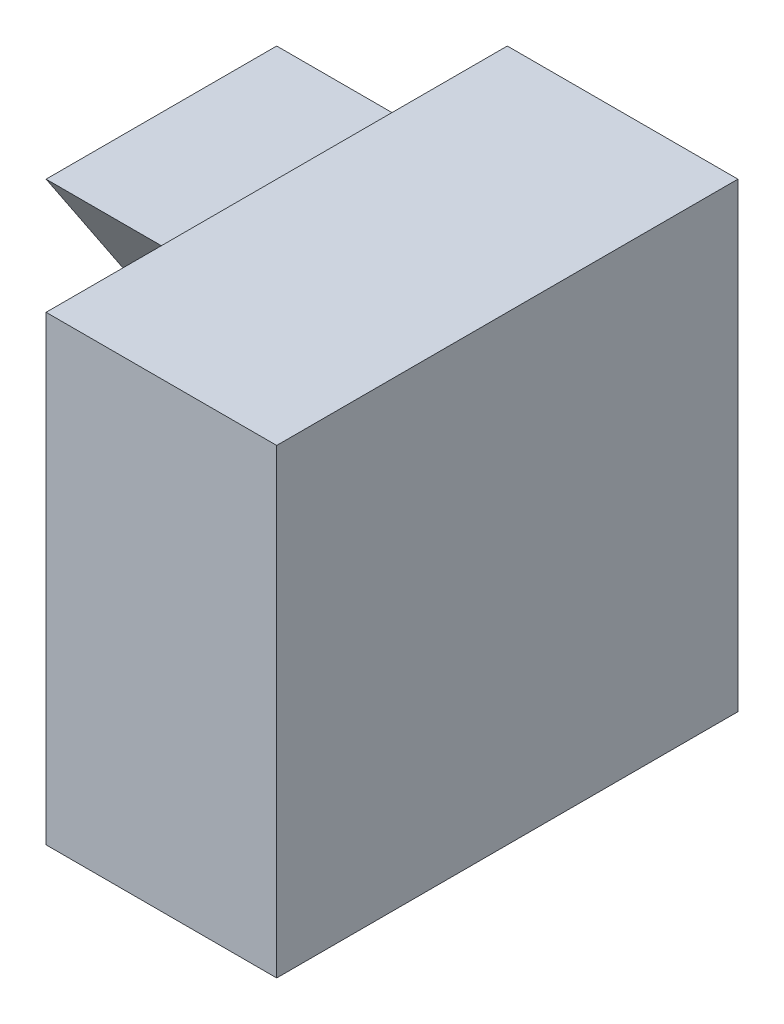
ISO-10303-21;
HEADER;
FILE_DESCRIPTION(('STEP AP214'),'2;1');
FILE_NAME('part.step','',(''),(''),'','','');
FILE_SCHEMA(('AUTOMOTIVE_DESIGN { 1 0 10303 214 1 1 1 1 }'));
ENDSEC;
DATA;
#1=APPLICATION_CONTEXT('core data for automotive mechanical design processes');
#2=APPLICATION_PROTOCOL_DEFINITION('international standard','automotive_design',2000,#1);
#3=PRODUCT_CONTEXT('',#1,'mechanical');
#4=PRODUCT('Part','Part','',(#3));
#5=PRODUCT_RELATED_PRODUCT_CATEGORY('part','',(#4));
#6=PRODUCT_DEFINITION_FORMATION('','',#4);
#7=PRODUCT_DEFINITION_CONTEXT('part definition',#1,'design');
#8=PRODUCT_DEFINITION('design','',#6,#7);
#9=PRODUCT_DEFINITION_SHAPE('','',#8);
#10=(LENGTH_UNIT() NAMED_UNIT(*) SI_UNIT(.MILLI.,.METRE.));
#11=(NAMED_UNIT(*) PLANE_ANGLE_UNIT() SI_UNIT($,.RADIAN.));
#12=(NAMED_UNIT(*) SI_UNIT($,.STERADIAN.) SOLID_ANGLE_UNIT());
#13=UNCERTAINTY_MEASURE_WITH_UNIT(LENGTH_MEASURE(1.E-05),#10,'distance_accuracy_value','');
#14=(GEOMETRIC_REPRESENTATION_CONTEXT(3) GLOBAL_UNCERTAINTY_ASSIGNED_CONTEXT((#13)) GLOBAL_UNIT_ASSIGNED_CONTEXT((#10,
#11,#12)) REPRESENTATION_CONTEXT('',''));
#15=CARTESIAN_POINT('',(0.,0.,0.));
#16=DIRECTION('',(0.,0.,1.));
#17=DIRECTION('',(1.,0.,0.));
#18=AXIS2_PLACEMENT_3D('',#15,#16,#17);
#19=CARTESIAN_POINT('',(2.,0.,0.));
#20=DIRECTION('',(0.,0.,-1.));
#21=DIRECTION('',(-1.,0.,0.));
#22=AXIS2_PLACEMENT_3D('',#19,#20,#21);
#23=PLANE('',#22);
#24=DIRECTION('',(0.,-1.,0.));
#25=VECTOR('',#24,1.);
#26=CARTESIAN_POINT('',(0.,0.,0.));
#27=LINE('',#26,#25);
#28=CARTESIAN_POINT('',(0.,4.,0.));
#29=VERTEX_POINT('',#28);
#30=CARTESIAN_POINT('',(0.,0.,0.));
#31=VERTEX_POINT('',#30);
#32=EDGE_CURVE('E119',#29,#31,#27,.T.);
#33=ORIENTED_EDGE('',*,*,#32,.T.);
#34=DIRECTION('',(-1.,0.,0.));
#35=VECTOR('',#34,1.);
#36=CARTESIAN_POINT('',(2.,0.,0.));
#37=LINE('',#36,#35);
#38=CARTESIAN_POINT('',(2.,0.,0.));
#39=VERTEX_POINT('',#38);
#40=EDGE_CURVE('E11',#39,#31,#37,.T.);
#41=ORIENTED_EDGE('',*,*,#40,.F.);
#42=DIRECTION('',(0.,-1.,0.));
#43=VECTOR('',#42,1.);
#44=CARTESIAN_POINT('',(2.,0.,0.));
#45=LINE('',#44,#43);
#46=CARTESIAN_POINT('',(2.,4.,0.));
#47=VERTEX_POINT('',#46);
#48=EDGE_CURVE('E129',#47,#39,#45,.T.);
#49=ORIENTED_EDGE('',*,*,#48,.F.);
#50=DIRECTION('',(-1.,0.,0.));
#51=VECTOR('',#50,1.);
#52=CARTESIAN_POINT('',(2.,4.,0.));
#53=LINE('',#52,#51);
#54=EDGE_CURVE('E134',#47,#29,#53,.T.);
#55=ORIENTED_EDGE('',*,*,#54,.T.);
#56=EDGE_LOOP('',(#33,#41,#49,#55));
#57=FACE_BOUND('',#56,.T.);
#58=ADVANCED_FACE('F33',(#57),#23,.F.);
#59=CARTESIAN_POINT('',(2.,0.,0.));
#60=DIRECTION('',(0.,1.,0.));
#61=DIRECTION('',(0.,0.,1.));
#62=AXIS2_PLACEMENT_3D('',#59,#60,#61);
#63=PLANE('',#62);
#64=DIRECTION('',(0.,0.,-1.));
#65=VECTOR('',#64,1.);
#66=CARTESIAN_POINT('',(0.,0.,0.));
#67=LINE('',#66,#65);
#68=CARTESIAN_POINT('',(0.,0.,-4.));
#69=VERTEX_POINT('',#68);
#70=EDGE_CURVE('E123',#31,#69,#67,.T.);
#71=ORIENTED_EDGE('',*,*,#70,.T.);
#72=DIRECTION('',(-1.,0.,0.));
#73=VECTOR('',#72,1.);
#74=CARTESIAN_POINT('',(2.,0.,-4.));
#75=LINE('',#74,#73);
#76=CARTESIAN_POINT('',(2.,0.,-4.));
#77=VERTEX_POINT('',#76);
#78=EDGE_CURVE('E41',#77,#69,#75,.T.);
#79=ORIENTED_EDGE('',*,*,#78,.F.);
#80=DIRECTION('',(0.,0.,-1.));
#81=VECTOR('',#80,1.);
#82=CARTESIAN_POINT('',(2.,0.,0.));
#83=LINE('',#82,#81);
#84=EDGE_CURVE('E81',#39,#77,#83,.T.);
#85=ORIENTED_EDGE('',*,*,#84,.F.);
#86=ORIENTED_EDGE('',*,*,#40,.T.);
#87=EDGE_LOOP('',(#71,#79,#85,#86));
#88=FACE_BOUND('',#87,.T.);
#89=ADVANCED_FACE('F150',(#88),#63,.F.);
#90=CARTESIAN_POINT('',(2.,0.,-4.));
#91=DIRECTION('',(0.,0.,1.));
#92=DIRECTION('',(1.,0.,0.));
#93=AXIS2_PLACEMENT_3D('',#90,#91,#92);
#94=PLANE('',#93);
#95=ORIENTED_EDGE('',*,*,#78,.T.);
#96=DIRECTION('',(-1.,0.,0.));
#97=VECTOR('',#96,1.);
#98=CARTESIAN_POINT('',(0.,0.,-4.));
#99=LINE('',#98,#97);
#100=CARTESIAN_POINT('',(-2.,0.,-4.));
#101=VERTEX_POINT('',#100);
#102=EDGE_CURVE('E105',#69,#101,#99,.T.);
#103=ORIENTED_EDGE('',*,*,#102,.T.);
#104=DIRECTION('',(0.,-1.,0.));
#105=VECTOR('',#104,1.);
#106=CARTESIAN_POINT('',(-2.,0.,-4.));
#107=LINE('',#106,#105);
#108=CARTESIAN_POINT('',(-2.,3.,-4.));
#109=VERTEX_POINT('',#108);
#110=EDGE_CURVE('E114',#109,#101,#107,.T.);
#111=ORIENTED_EDGE('',*,*,#110,.F.);
#112=DIRECTION('',(1.,0.,0.));
#113=VECTOR('',#112,1.);
#114=CARTESIAN_POINT('',(-2.,3.,-4.));
#115=LINE('',#114,#113);
#116=CARTESIAN_POINT('',(0.,3.,-4.));
#117=VERTEX_POINT('',#116);
#118=EDGE_CURVE('E120',#109,#117,#115,.T.);
#119=ORIENTED_EDGE('',*,*,#118,.T.);
#120=DIRECTION('',(0.,1.,0.));
#121=VECTOR('',#120,1.);
#122=CARTESIAN_POINT('',(0.,0.,-4.));
#123=LINE('',#122,#121);
#124=CARTESIAN_POINT('',(0.,4.,-4.));
#125=VERTEX_POINT('',#124);
#126=EDGE_CURVE('E49',#117,#125,#123,.T.);
#127=ORIENTED_EDGE('',*,*,#126,.T.);
#128=DIRECTION('',(-1.,0.,0.));
#129=VECTOR('',#128,1.);
#130=CARTESIAN_POINT('',(2.,4.,-4.));
#131=LINE('',#130,#129);
#132=CARTESIAN_POINT('',(2.,4.,-4.));
#133=VERTEX_POINT('',#132);
#134=EDGE_CURVE('E144',#133,#125,#131,.T.);
#135=ORIENTED_EDGE('',*,*,#134,.F.);
#136=DIRECTION('',(0.,1.,0.));
#137=VECTOR('',#136,1.);
#138=CARTESIAN_POINT('',(2.,0.,-4.));
#139=LINE('',#138,#137);
#140=EDGE_CURVE('E132',#77,#133,#139,.T.);
#141=ORIENTED_EDGE('',*,*,#140,.F.);
#142=EDGE_LOOP('',(#95,#103,#111,#119,#127,#135,#141));
#143=FACE_BOUND('',#142,.T.);
#144=ADVANCED_FACE('F152',(#143),#94,.F.);
#145=CARTESIAN_POINT('',(2.,4.,0.));
#146=DIRECTION('',(0.,-1.,0.));
#147=DIRECTION('',(0.,0.,-1.));
#148=AXIS2_PLACEMENT_3D('',#145,#146,#147);
#149=PLANE('',#148);
#150=DIRECTION('',(0.,0.,1.));
#151=VECTOR('',#150,1.);
#152=CARTESIAN_POINT('',(0.,4.,0.));
#153=LINE('',#152,#151);
#154=EDGE_CURVE('E74',#125,#29,#153,.T.);
#155=ORIENTED_EDGE('',*,*,#154,.T.);
#156=ORIENTED_EDGE('',*,*,#54,.F.);
#157=DIRECTION('',(0.,0.,1.));
#158=VECTOR('',#157,1.);
#159=CARTESIAN_POINT('',(2.,4.,0.));
#160=LINE('',#159,#158);
#161=EDGE_CURVE('E58',#133,#47,#160,.T.);
#162=ORIENTED_EDGE('',*,*,#161,.F.);
#163=ORIENTED_EDGE('',*,*,#134,.T.);
#164=EDGE_LOOP('',(#155,#156,#162,#163));
#165=FACE_BOUND('',#164,.T.);
#166=ADVANCED_FACE('F157',(#165),#149,.F.);
#167=CARTESIAN_POINT('',(2.,0.,0.));
#168=DIRECTION('',(-1.,0.,0.));
#169=DIRECTION('',(0.,0.,1.));
#170=AXIS2_PLACEMENT_3D('',#167,#168,#169);
#171=PLANE('',#170);
#172=ORIENTED_EDGE('',*,*,#48,.T.);
#173=ORIENTED_EDGE('',*,*,#84,.T.);
#174=ORIENTED_EDGE('',*,*,#140,.T.);
#175=ORIENTED_EDGE('',*,*,#161,.T.);
#176=EDGE_LOOP('',(#172,#173,#174,#175));
#177=FACE_BOUND('',#176,.T.);
#178=ADVANCED_FACE('F164',(#177),#171,.F.);
#179=CARTESIAN_POINT('',(0.,0.,0.));
#180=DIRECTION('',(-1.,0.,0.));
#181=DIRECTION('',(0.,0.,1.));
#182=AXIS2_PLACEMENT_3D('',#179,#180,#181);
#183=PLANE('',#182);
#184=DIRECTION('',(0.,0.,-1.));
#185=VECTOR('',#184,1.);
#186=CARTESIAN_POINT('',(0.,3.,-4.));
#187=LINE('',#186,#185);
#188=CARTESIAN_POINT('',(0.,3.,-2.));
#189=VERTEX_POINT('',#188);
#190=EDGE_CURVE('E109',#189,#117,#187,.T.);
#191=ORIENTED_EDGE('',*,*,#190,.F.);
#192=DIRECTION('',(0.,-0.832050294337844,-0.554700196225229));
#193=VECTOR('',#192,1.);
#194=CARTESIAN_POINT('',(0.,3.,-2.));
#195=LINE('',#194,#193);
#196=EDGE_CURVE('E99',#189,#69,#195,.T.);
#197=ORIENTED_EDGE('',*,*,#196,.T.);
#198=ORIENTED_EDGE('',*,*,#70,.F.);
#199=ORIENTED_EDGE('',*,*,#32,.F.);
#200=ORIENTED_EDGE('',*,*,#154,.F.);
#201=ORIENTED_EDGE('',*,*,#126,.F.);
#202=EDGE_LOOP('',(#191,#197,#198,#199,#200,#201));
#203=FACE_BOUND('',#202,.T.);
#204=ADVANCED_FACE('F110',(#203),#183,.T.);
#205=CARTESIAN_POINT('',(-2.,3.,-4.));
#206=DIRECTION('',(0.,-1.,0.));
#207=DIRECTION('',(0.,0.,-1.));
#208=AXIS2_PLACEMENT_3D('',#205,#206,#207);
#209=PLANE('',#208);
#210=ORIENTED_EDGE('',*,*,#190,.T.);
#211=ORIENTED_EDGE('',*,*,#118,.F.);
#212=DIRECTION('',(0.,0.,-1.));
#213=VECTOR('',#212,1.);
#214=CARTESIAN_POINT('',(-2.,3.,-4.));
#215=LINE('',#214,#213);
#216=CARTESIAN_POINT('',(-2.,3.,-2.));
#217=VERTEX_POINT('',#216);
#218=EDGE_CURVE('E118',#217,#109,#215,.T.);
#219=ORIENTED_EDGE('',*,*,#218,.F.);
#220=DIRECTION('',(1.,0.,0.));
#221=VECTOR('',#220,1.);
#222=CARTESIAN_POINT('',(-2.,3.,-2.));
#223=LINE('',#222,#221);
#224=EDGE_CURVE('E102',#217,#189,#223,.T.);
#225=ORIENTED_EDGE('',*,*,#224,.T.);
#226=EDGE_LOOP('',(#210,#211,#219,#225));
#227=FACE_BOUND('',#226,.T.);
#228=ADVANCED_FACE('F117',(#227),#209,.F.);
#229=CARTESIAN_POINT('',(-2.,0.,0.));
#230=DIRECTION('',(1.,0.,0.));
#231=DIRECTION('',(0.,0.,-1.));
#232=AXIS2_PLACEMENT_3D('',#229,#230,#231);
#233=PLANE('',#232);
#234=ORIENTED_EDGE('',*,*,#110,.T.);
#235=DIRECTION('',(0.,-0.832050294337844,-0.554700196225229));
#236=VECTOR('',#235,1.);
#237=CARTESIAN_POINT('',(-2.,3.,-2.));
#238=LINE('',#237,#236);
#239=EDGE_CURVE('E107',#217,#101,#238,.T.);
#240=ORIENTED_EDGE('',*,*,#239,.F.);
#241=ORIENTED_EDGE('',*,*,#218,.T.);
#242=EDGE_LOOP('',(#234,#240,#241));
#243=FACE_BOUND('',#242,.T.);
#244=ADVANCED_FACE('F171',(#243),#233,.F.);
#245=CARTESIAN_POINT('',(0.,3.,-2.));
#246=DIRECTION('',(0.,0.554700196225229,-0.832050294337844));
#247=DIRECTION('',(0.,0.832050294337844,0.554700196225229));
#248=AXIS2_PLACEMENT_3D('',#245,#246,#247);
#249=PLANE('',#248);
#250=ORIENTED_EDGE('',*,*,#239,.T.);
#251=ORIENTED_EDGE('',*,*,#102,.F.);
#252=ORIENTED_EDGE('',*,*,#196,.F.);
#253=ORIENTED_EDGE('',*,*,#224,.F.);
#254=EDGE_LOOP('',(#250,#251,#252,#253));
#255=FACE_BOUND('',#254,.T.);
#256=ADVANCED_FACE('F100',(#255),#249,.F.);
#257=CLOSED_SHELL('',(#58,#89,#144,#166,#178,#204,#228,#244,#256));
#258=MANIFOLD_SOLID_BREP('B2',#257);
#259=ADVANCED_BREP_SHAPE_REPRESENTATION('',(#18,#258),#14);
#260=SHAPE_DEFINITION_REPRESENTATION(#9,#259);
ENDSEC;
END-ISO-10303-21;
